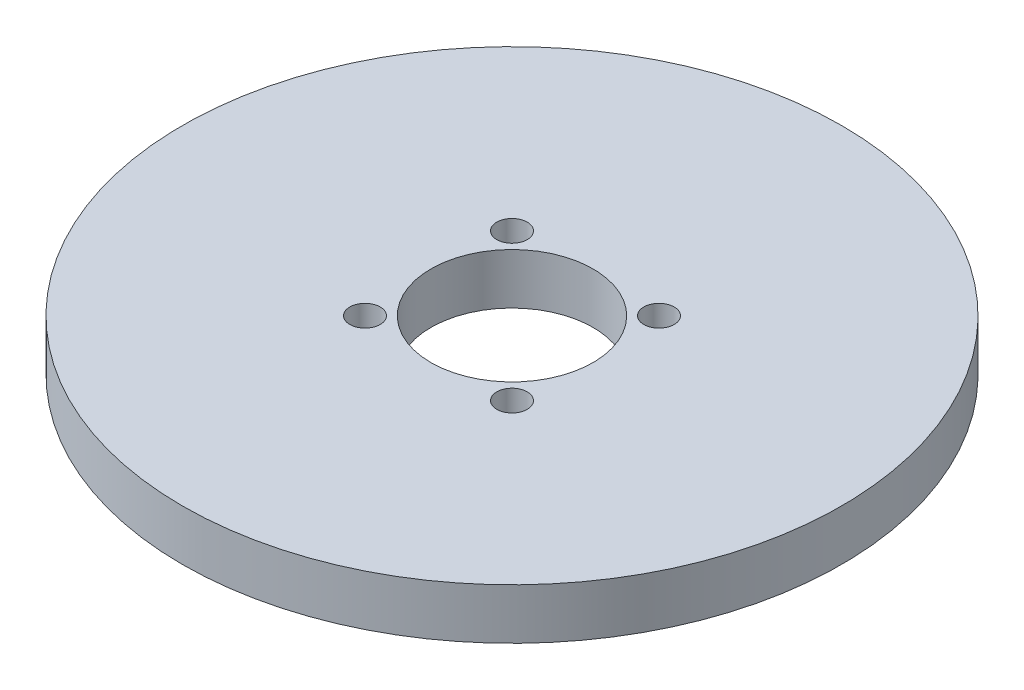
ISO-10303-21;
HEADER;
FILE_DESCRIPTION(('STEP AP214'),'2;1');
FILE_NAME('part.step','',(''),(''),'','','');
FILE_SCHEMA(('AUTOMOTIVE_DESIGN { 1 0 10303 214 1 1 1 1 }'));
ENDSEC;
DATA;
#1=APPLICATION_CONTEXT('core data for automotive mechanical design processes');
#2=APPLICATION_PROTOCOL_DEFINITION('international standard','automotive_design',2000,#1);
#3=PRODUCT_CONTEXT('',#1,'mechanical');
#4=PRODUCT('Part','Part','',(#3));
#5=PRODUCT_RELATED_PRODUCT_CATEGORY('part','',(#4));
#6=PRODUCT_DEFINITION_FORMATION('','',#4);
#7=PRODUCT_DEFINITION_CONTEXT('part definition',#1,'design');
#8=PRODUCT_DEFINITION('design','',#6,#7);
#9=PRODUCT_DEFINITION_SHAPE('','',#8);
#10=(LENGTH_UNIT() NAMED_UNIT(*) SI_UNIT(.MILLI.,.METRE.));
#11=(NAMED_UNIT(*) PLANE_ANGLE_UNIT() SI_UNIT($,.RADIAN.));
#12=(NAMED_UNIT(*) SI_UNIT($,.STERADIAN.) SOLID_ANGLE_UNIT());
#13=UNCERTAINTY_MEASURE_WITH_UNIT(LENGTH_MEASURE(1.E-05),#10,'distance_accuracy_value','');
#14=(GEOMETRIC_REPRESENTATION_CONTEXT(3) GLOBAL_UNCERTAINTY_ASSIGNED_CONTEXT((#13)) GLOBAL_UNIT_ASSIGNED_CONTEXT((#10,
#11,#12)) REPRESENTATION_CONTEXT('',''));
#15=CARTESIAN_POINT('',(0.,0.,0.));
#16=DIRECTION('',(0.,0.,1.));
#17=DIRECTION('',(1.,0.,0.));
#18=AXIS2_PLACEMENT_3D('',#15,#16,#17);
#19=CARTESIAN_POINT('',(0.,5.,0.));
#20=DIRECTION('',(0.,1.,0.));
#21=DIRECTION('',(0.,0.,1.));
#22=AXIS2_PLACEMENT_3D('',#19,#20,#21);
#23=PLANE('',#22);
#24=CARTESIAN_POINT('',(7.24784450716207,5.,7.24784450716215));
#25=DIRECTION('',(0.,1.,0.));
#26=DIRECTION('',(0.,0.,1.));
#27=AXIS2_PLACEMENT_3D('',#24,#25,#26);
#28=CIRCLE('',#27,1.5);
#29=CARTESIAN_POINT('',(7.24784450716207,5.,8.74784450716215));
#30=VERTEX_POINT('',#29);
#31=EDGE_CURVE('E74',#30,#30,#28,.T.);
#32=ORIENTED_EDGE('',*,*,#31,.F.);
#33=EDGE_LOOP('',(#32));
#34=FACE_BOUND('',#33,.T.);
#35=CARTESIAN_POINT('',(-7.24784450716213,5.,-7.2478445071621));
#36=DIRECTION('',(0.,1.,0.));
#37=DIRECTION('',(0.,0.,1.));
#38=AXIS2_PLACEMENT_3D('',#35,#36,#37);
#39=CIRCLE('',#38,1.5);
#40=CARTESIAN_POINT('',(-7.24784450716213,5.,-5.7478445071621));
#41=VERTEX_POINT('',#40);
#42=EDGE_CURVE('E58',#41,#41,#39,.T.);
#43=ORIENTED_EDGE('',*,*,#42,.F.);
#44=EDGE_LOOP('',(#43));
#45=FACE_BOUND('',#44,.T.);
#46=CARTESIAN_POINT('',(0.,5.,0.));
#47=DIRECTION('',(0.,1.,0.));
#48=DIRECTION('',(0.,0.,1.));
#49=AXIS2_PLACEMENT_3D('',#46,#47,#48);
#50=CIRCLE('',#49,32.5);
#51=CARTESIAN_POINT('',(0.,5.,32.5));
#52=VERTEX_POINT('',#51);
#53=EDGE_CURVE('E10',#52,#52,#50,.T.);
#54=ORIENTED_EDGE('',*,*,#53,.T.);
#55=EDGE_LOOP('',(#54));
#56=FACE_BOUND('',#55,.T.);
#57=CARTESIAN_POINT('',(0.,5.,0.));
#58=DIRECTION('',(0.,1.,0.));
#59=DIRECTION('',(0.,0.,1.));
#60=AXIS2_PLACEMENT_3D('',#57,#58,#59);
#61=CIRCLE('',#60,8.);
#62=CARTESIAN_POINT('',(0.,5.,8.));
#63=VERTEX_POINT('',#62);
#64=EDGE_CURVE('E52',#63,#63,#61,.T.);
#65=ORIENTED_EDGE('',*,*,#64,.F.);
#66=EDGE_LOOP('',(#65));
#67=FACE_BOUND('',#66,.T.);
#68=CARTESIAN_POINT('',(7.24784450716212,5.,-7.2478445071621));
#69=DIRECTION('',(0.,1.,0.));
#70=DIRECTION('',(0.,0.,1.));
#71=AXIS2_PLACEMENT_3D('',#68,#69,#70);
#72=CIRCLE('',#71,1.5);
#73=CARTESIAN_POINT('',(7.24784450716212,5.,-5.7478445071621));
#74=VERTEX_POINT('',#73);
#75=EDGE_CURVE('E66',#74,#74,#72,.T.);
#76=ORIENTED_EDGE('',*,*,#75,.F.);
#77=EDGE_LOOP('',(#76));
#78=FACE_BOUND('',#77,.T.);
#79=CARTESIAN_POINT('',(-7.24784450716217,5.,7.24784450716205));
#80=DIRECTION('',(0.,1.,0.));
#81=DIRECTION('',(0.,0.,1.));
#82=AXIS2_PLACEMENT_3D('',#79,#80,#81);
#83=CIRCLE('',#82,1.5);
#84=CARTESIAN_POINT('',(-7.24784450716217,5.,8.74784450716205));
#85=VERTEX_POINT('',#84);
#86=EDGE_CURVE('E82',#85,#85,#83,.T.);
#87=ORIENTED_EDGE('',*,*,#86,.F.);
#88=EDGE_LOOP('',(#87));
#89=FACE_BOUND('',#88,.T.);
#90=ADVANCED_FACE('F39',(#34,#45,#56,#67,#78,#89),#23,.T.);
#91=CARTESIAN_POINT('',(0.,0.,0.));
#92=DIRECTION('',(0.,1.,0.));
#93=DIRECTION('',(0.,0.,1.));
#94=AXIS2_PLACEMENT_3D('',#91,#92,#93);
#95=PLANE('',#94);
#96=CARTESIAN_POINT('',(0.,0.,0.));
#97=DIRECTION('',(0.,1.,0.));
#98=DIRECTION('',(0.,0.,1.));
#99=AXIS2_PLACEMENT_3D('',#96,#97,#98);
#100=CIRCLE('',#99,32.5);
#101=CARTESIAN_POINT('',(0.,0.,32.5));
#102=VERTEX_POINT('',#101);
#103=EDGE_CURVE('E43',#102,#102,#100,.T.);
#104=ORIENTED_EDGE('',*,*,#103,.F.);
#105=EDGE_LOOP('',(#104));
#106=FACE_BOUND('',#105,.T.);
#107=CARTESIAN_POINT('',(0.,0.,0.));
#108=DIRECTION('',(0.,1.,0.));
#109=DIRECTION('',(0.,0.,1.));
#110=AXIS2_PLACEMENT_3D('',#107,#108,#109);
#111=CIRCLE('',#110,8.);
#112=CARTESIAN_POINT('',(0.,0.,8.));
#113=VERTEX_POINT('',#112);
#114=EDGE_CURVE('E54',#113,#113,#111,.T.);
#115=ORIENTED_EDGE('',*,*,#114,.T.);
#116=EDGE_LOOP('',(#115));
#117=FACE_BOUND('',#116,.T.);
#118=CARTESIAN_POINT('',(-7.24784450716213,0.,-7.2478445071621));
#119=DIRECTION('',(0.,1.,0.));
#120=DIRECTION('',(0.,0.,1.));
#121=AXIS2_PLACEMENT_3D('',#118,#119,#120);
#122=CIRCLE('',#121,1.5);
#123=CARTESIAN_POINT('',(-7.24784450716213,0.,-5.7478445071621));
#124=VERTEX_POINT('',#123);
#125=EDGE_CURVE('E62',#124,#124,#122,.T.);
#126=ORIENTED_EDGE('',*,*,#125,.T.);
#127=EDGE_LOOP('',(#126));
#128=FACE_BOUND('',#127,.T.);
#129=CARTESIAN_POINT('',(7.24784450716212,0.,-7.2478445071621));
#130=DIRECTION('',(0.,1.,0.));
#131=DIRECTION('',(0.,0.,1.));
#132=AXIS2_PLACEMENT_3D('',#129,#130,#131);
#133=CIRCLE('',#132,1.5);
#134=CARTESIAN_POINT('',(7.24784450716212,0.,-5.7478445071621));
#135=VERTEX_POINT('',#134);
#136=EDGE_CURVE('E70',#135,#135,#133,.T.);
#137=ORIENTED_EDGE('',*,*,#136,.T.);
#138=EDGE_LOOP('',(#137));
#139=FACE_BOUND('',#138,.T.);
#140=CARTESIAN_POINT('',(7.24784450716207,0.,7.24784450716215));
#141=DIRECTION('',(0.,1.,0.));
#142=DIRECTION('',(0.,0.,1.));
#143=AXIS2_PLACEMENT_3D('',#140,#141,#142);
#144=CIRCLE('',#143,1.5);
#145=CARTESIAN_POINT('',(7.24784450716207,0.,8.74784450716215));
#146=VERTEX_POINT('',#145);
#147=EDGE_CURVE('E78',#146,#146,#144,.T.);
#148=ORIENTED_EDGE('',*,*,#147,.T.);
#149=EDGE_LOOP('',(#148));
#150=FACE_BOUND('',#149,.T.);
#151=CARTESIAN_POINT('',(-7.24784450716217,0.,7.24784450716205));
#152=DIRECTION('',(0.,1.,0.));
#153=DIRECTION('',(0.,0.,1.));
#154=AXIS2_PLACEMENT_3D('',#151,#152,#153);
#155=CIRCLE('',#154,1.5);
#156=CARTESIAN_POINT('',(-7.24784450716217,0.,8.74784450716205));
#157=VERTEX_POINT('',#156);
#158=EDGE_CURVE('E86',#157,#157,#155,.T.);
#159=ORIENTED_EDGE('',*,*,#158,.T.);
#160=EDGE_LOOP('',(#159));
#161=FACE_BOUND('',#160,.T.);
#162=ADVANCED_FACE('F98',(#106,#117,#128,#139,#150,#161),#95,.F.);
#163=CARTESIAN_POINT('',(0.,5.,0.));
#164=DIRECTION('',(0.,-1.,0.));
#165=DIRECTION('',(0.,0.,-1.));
#166=AXIS2_PLACEMENT_3D('',#163,#164,#165);
#167=CYLINDRICAL_SURFACE('',#166,32.5);
#168=ORIENTED_EDGE('',*,*,#53,.F.);
#169=EDGE_LOOP('',(#168));
#170=FACE_BOUND('',#169,.T.);
#171=ORIENTED_EDGE('',*,*,#103,.T.);
#172=EDGE_LOOP('',(#171));
#173=FACE_BOUND('',#172,.T.);
#174=ADVANCED_FACE('F41',(#170,#173),#167,.T.);
#175=CARTESIAN_POINT('',(0.,5.,0.));
#176=DIRECTION('',(0.,-1.,0.));
#177=DIRECTION('',(0.,0.,-1.));
#178=AXIS2_PLACEMENT_3D('',#175,#176,#177);
#179=CYLINDRICAL_SURFACE('',#178,8.);
#180=ORIENTED_EDGE('',*,*,#64,.T.);
#181=EDGE_LOOP('',(#180));
#182=FACE_BOUND('',#181,.T.);
#183=ORIENTED_EDGE('',*,*,#114,.F.);
#184=EDGE_LOOP('',(#183));
#185=FACE_BOUND('',#184,.T.);
#186=ADVANCED_FACE('F108',(#182,#185),#179,.F.);
#187=CARTESIAN_POINT('',(-7.24784450716213,5.,-7.2478445071621));
#188=DIRECTION('',(0.,-1.,0.));
#189=DIRECTION('',(0.,0.,-1.));
#190=AXIS2_PLACEMENT_3D('',#187,#188,#189);
#191=CYLINDRICAL_SURFACE('',#190,1.5);
#192=ORIENTED_EDGE('',*,*,#42,.T.);
#193=EDGE_LOOP('',(#192));
#194=FACE_BOUND('',#193,.T.);
#195=ORIENTED_EDGE('',*,*,#125,.F.);
#196=EDGE_LOOP('',(#195));
#197=FACE_BOUND('',#196,.T.);
#198=ADVANCED_FACE('F111',(#194,#197),#191,.F.);
#199=CARTESIAN_POINT('',(7.24784450716212,5.,-7.2478445071621));
#200=DIRECTION('',(0.,-1.,0.));
#201=DIRECTION('',(0.,0.,-1.));
#202=AXIS2_PLACEMENT_3D('',#199,#200,#201);
#203=CYLINDRICAL_SURFACE('',#202,1.5);
#204=ORIENTED_EDGE('',*,*,#75,.T.);
#205=EDGE_LOOP('',(#204));
#206=FACE_BOUND('',#205,.T.);
#207=ORIENTED_EDGE('',*,*,#136,.F.);
#208=EDGE_LOOP('',(#207));
#209=FACE_BOUND('',#208,.T.);
#210=ADVANCED_FACE('F115',(#206,#209),#203,.F.);
#211=CARTESIAN_POINT('',(7.24784450716207,5.,7.24784450716215));
#212=DIRECTION('',(0.,-1.,0.));
#213=DIRECTION('',(0.,0.,-1.));
#214=AXIS2_PLACEMENT_3D('',#211,#212,#213);
#215=CYLINDRICAL_SURFACE('',#214,1.5);
#216=ORIENTED_EDGE('',*,*,#31,.T.);
#217=EDGE_LOOP('',(#216));
#218=FACE_BOUND('',#217,.T.);
#219=ORIENTED_EDGE('',*,*,#147,.F.);
#220=EDGE_LOOP('',(#219));
#221=FACE_BOUND('',#220,.T.);
#222=ADVANCED_FACE('F119',(#218,#221),#215,.F.);
#223=CARTESIAN_POINT('',(-7.24784450716217,5.,7.24784450716205));
#224=DIRECTION('',(0.,-1.,0.));
#225=DIRECTION('',(0.,0.,-1.));
#226=AXIS2_PLACEMENT_3D('',#223,#224,#225);
#227=CYLINDRICAL_SURFACE('',#226,1.5);
#228=ORIENTED_EDGE('',*,*,#86,.T.);
#229=EDGE_LOOP('',(#228));
#230=FACE_BOUND('',#229,.T.);
#231=ORIENTED_EDGE('',*,*,#158,.F.);
#232=EDGE_LOOP('',(#231));
#233=FACE_BOUND('',#232,.T.);
#234=ADVANCED_FACE('F94',(#230,#233),#227,.F.);
#235=CLOSED_SHELL('',(#90,#162,#174,#186,#198,#210,#222,#234));
#236=MANIFOLD_SOLID_BREP('B2',#235);
#237=ADVANCED_BREP_SHAPE_REPRESENTATION('',(#18,#236),#14);
#238=SHAPE_DEFINITION_REPRESENTATION(#9,#237);
ENDSEC;
END-ISO-10303-21;
